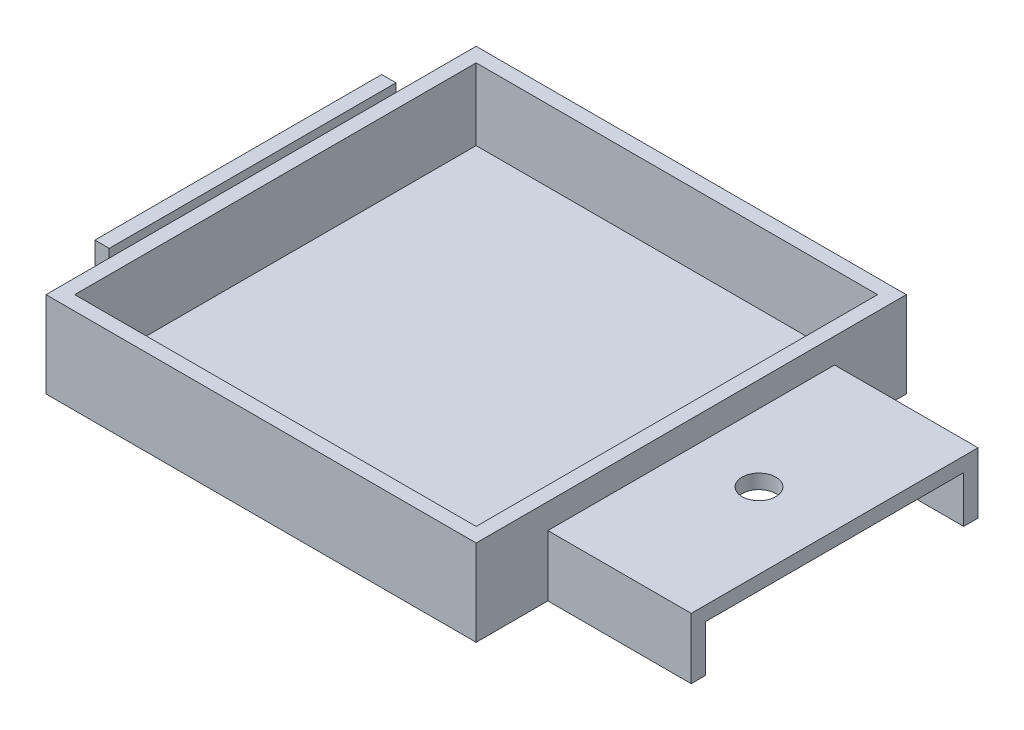
ISO-10303-21;
HEADER;
FILE_DESCRIPTION(('STEP AP214'),'2;1');
FILE_NAME('part.step','',(''),(''),'','','');
FILE_SCHEMA(('AUTOMOTIVE_DESIGN { 1 0 10303 214 1 1 1 1 }'));
ENDSEC;
DATA;
#1=APPLICATION_CONTEXT('core data for automotive mechanical design processes');
#2=APPLICATION_PROTOCOL_DEFINITION('international standard','automotive_design',2000,#1);
#3=PRODUCT_CONTEXT('',#1,'mechanical');
#4=PRODUCT('Part','Part','',(#3));
#5=PRODUCT_RELATED_PRODUCT_CATEGORY('part','',(#4));
#6=PRODUCT_DEFINITION_FORMATION('','',#4);
#7=PRODUCT_DEFINITION_CONTEXT('part definition',#1,'design');
#8=PRODUCT_DEFINITION('design','',#6,#7);
#9=PRODUCT_DEFINITION_SHAPE('','',#8);
#10=(LENGTH_UNIT() NAMED_UNIT(*) SI_UNIT(.MILLI.,.METRE.));
#11=(NAMED_UNIT(*) PLANE_ANGLE_UNIT() SI_UNIT($,.RADIAN.));
#12=(NAMED_UNIT(*) SI_UNIT($,.STERADIAN.) SOLID_ANGLE_UNIT());
#13=UNCERTAINTY_MEASURE_WITH_UNIT(LENGTH_MEASURE(1.E-05),#10,'distance_accuracy_value','');
#14=(GEOMETRIC_REPRESENTATION_CONTEXT(3) GLOBAL_UNCERTAINTY_ASSIGNED_CONTEXT((#13)) GLOBAL_UNIT_ASSIGNED_CONTEXT((#10,
#11,#12)) REPRESENTATION_CONTEXT('',''));
#15=CARTESIAN_POINT('',(0.,0.,0.));
#16=DIRECTION('',(0.,0.,1.));
#17=DIRECTION('',(1.,0.,0.));
#18=AXIS2_PLACEMENT_3D('',#15,#16,#17);
#19=CARTESIAN_POINT('',(0.,2.54,0.));
#20=DIRECTION('',(1.,0.,0.));
#21=DIRECTION('',(0.,0.,-1.));
#22=AXIS2_PLACEMENT_3D('',#19,#20,#21);
#23=PLANE('',#22);
#24=DIRECTION('',(0.,-1.,0.));
#25=VECTOR('',#24,1.);
#26=CARTESIAN_POINT('',(0.,2.54,-63.5));
#27=LINE('',#26,#25);
#28=CARTESIAN_POINT('',(0.,2.54,-63.5));
#29=VERTEX_POINT('',#28);
#30=CARTESIAN_POINT('',(0.,0.,-63.5));
#31=VERTEX_POINT('',#30);
#32=EDGE_CURVE('E58',#29,#31,#27,.T.);
#33=ORIENTED_EDGE('',*,*,#32,.F.);
#34=DIRECTION('',(0.,0.,-1.));
#35=VECTOR('',#34,1.);
#36=CARTESIAN_POINT('',(0.,2.54,-63.5));
#37=LINE('',#36,#35);
#38=CARTESIAN_POINT('',(0.,2.54,-12.7));
#39=VERTEX_POINT('',#38);
#40=EDGE_CURVE('E246',#39,#29,#37,.T.);
#41=ORIENTED_EDGE('',*,*,#40,.F.);
#42=DIRECTION('',(0.,1.,0.));
#43=VECTOR('',#42,1.);
#44=CARTESIAN_POINT('',(0.,2.54,-12.7));
#45=LINE('',#44,#43);
#46=CARTESIAN_POINT('',(0.,0.,-12.7));
#47=VERTEX_POINT('',#46);
#48=EDGE_CURVE('E64',#47,#39,#45,.T.);
#49=ORIENTED_EDGE('',*,*,#48,.F.);
#50=DIRECTION('',(0.,0.,1.));
#51=VECTOR('',#50,1.);
#52=CARTESIAN_POINT('',(0.,0.,0.));
#53=LINE('',#52,#51);
#54=CARTESIAN_POINT('',(0.,0.,0.));
#55=VERTEX_POINT('',#54);
#56=EDGE_CURVE('E406',#47,#55,#53,.T.);
#57=ORIENTED_EDGE('',*,*,#56,.T.);
#58=DIRECTION('',(0.,-1.,0.));
#59=VECTOR('',#58,1.);
#60=CARTESIAN_POINT('',(0.,2.54,0.));
#61=LINE('',#60,#59);
#62=CARTESIAN_POINT('',(0.,15.24,0.));
#63=VERTEX_POINT('',#62);
#64=EDGE_CURVE('E11',#63,#55,#61,.T.);
#65=ORIENTED_EDGE('',*,*,#64,.F.);
#66=DIRECTION('',(0.,0.,1.));
#67=VECTOR('',#66,1.);
#68=CARTESIAN_POINT('',(0.,15.24,-76.2));
#69=LINE('',#68,#67);
#70=CARTESIAN_POINT('',(0.,15.24,-76.2));
#71=VERTEX_POINT('',#70);
#72=EDGE_CURVE('E390',#71,#63,#69,.T.);
#73=ORIENTED_EDGE('',*,*,#72,.F.);
#74=DIRECTION('',(0.,-1.,0.));
#75=VECTOR('',#74,1.);
#76=CARTESIAN_POINT('',(0.,2.54,-76.2));
#77=LINE('',#76,#75);
#78=CARTESIAN_POINT('',(0.,0.,-76.2));
#79=VERTEX_POINT('',#78);
#80=EDGE_CURVE('E422',#71,#79,#77,.T.);
#81=ORIENTED_EDGE('',*,*,#80,.T.);
#82=EDGE_CURVE('E407',#79,#31,#53,.T.);
#83=ORIENTED_EDGE('',*,*,#82,.T.);
#84=EDGE_LOOP('',(#33,#41,#49,#57,#65,#73,#81,#83));
#85=FACE_BOUND('',#84,.T.);
#86=ADVANCED_FACE('F43',(#85),#23,.F.);
#87=CARTESIAN_POINT('',(76.2,2.54,0.));
#88=DIRECTION('',(-1.,0.,0.));
#89=DIRECTION('',(0.,0.,1.));
#90=AXIS2_PLACEMENT_3D('',#87,#88,#89);
#91=PLANE('',#90);
#92=DIRECTION('',(0.,1.,0.));
#93=VECTOR('',#92,1.);
#94=CARTESIAN_POINT('',(76.2,-25.5266840776471,-60.96));
#95=LINE('',#94,#93);
#96=CARTESIAN_POINT('',(76.2,0.,-60.96));
#97=VERTEX_POINT('',#96);
#98=CARTESIAN_POINT('',(76.2,8.255,-60.96));
#99=VERTEX_POINT('',#98);
#100=EDGE_CURVE('E261',#97,#99,#95,.T.);
#101=ORIENTED_EDGE('',*,*,#100,.T.);
#102=DIRECTION('',(0.,0.,-1.));
#103=VECTOR('',#102,1.);
#104=CARTESIAN_POINT('',(76.2,8.255,-12.7));
#105=LINE('',#104,#103);
#106=CARTESIAN_POINT('',(76.2,8.255,-15.24));
#107=VERTEX_POINT('',#106);
#108=EDGE_CURVE('E330',#107,#99,#105,.T.);
#109=ORIENTED_EDGE('',*,*,#108,.F.);
#110=DIRECTION('',(0.,1.,0.));
#111=VECTOR('',#110,1.);
#112=CARTESIAN_POINT('',(76.2,-25.5266840776471,-15.24));
#113=LINE('',#112,#111);
#114=CARTESIAN_POINT('',(76.2,0.,-15.24));
#115=VERTEX_POINT('',#114);
#116=EDGE_CURVE('E270',#115,#107,#113,.T.);
#117=ORIENTED_EDGE('',*,*,#116,.F.);
#118=DIRECTION('',(0.,0.,-1.));
#119=VECTOR('',#118,1.);
#120=CARTESIAN_POINT('',(76.2,0.,0.));
#121=LINE('',#120,#119);
#122=EDGE_CURVE('E419',#115,#97,#121,.T.);
#123=ORIENTED_EDGE('',*,*,#122,.T.);
#124=EDGE_LOOP('',(#101,#109,#117,#123));
#125=FACE_BOUND('',#124,.T.);
#126=ADVANCED_FACE('F468',(#125),#91,.F.);
#127=DIRECTION('',(0.,1.,0.));
#128=VECTOR('',#127,1.);
#129=CARTESIAN_POINT('',(76.2,10.795,-63.5));
#130=LINE('',#129,#128);
#131=CARTESIAN_POINT('',(76.2,0.,-63.5));
#132=VERTEX_POINT('',#131);
#133=CARTESIAN_POINT('',(76.2,10.795,-63.5));
#134=VERTEX_POINT('',#133);
#135=EDGE_CURVE('E334',#132,#134,#130,.T.);
#136=ORIENTED_EDGE('',*,*,#135,.F.);
#137=CARTESIAN_POINT('',(76.2,0.,-76.2));
#138=VERTEX_POINT('',#137);
#139=EDGE_CURVE('E413',#132,#138,#121,.T.);
#140=ORIENTED_EDGE('',*,*,#139,.T.);
#141=DIRECTION('',(0.,-1.,0.));
#142=VECTOR('',#141,1.);
#143=CARTESIAN_POINT('',(76.2,2.54,-76.2));
#144=LINE('',#143,#142);
#145=CARTESIAN_POINT('',(76.2,15.24,-76.2));
#146=VERTEX_POINT('',#145);
#147=EDGE_CURVE('E426',#146,#138,#144,.T.);
#148=ORIENTED_EDGE('',*,*,#147,.F.);
#149=DIRECTION('',(0.,0.,-1.));
#150=VECTOR('',#149,1.);
#151=CARTESIAN_POINT('',(76.2,15.24,-76.2));
#152=LINE('',#151,#150);
#153=CARTESIAN_POINT('',(76.2,15.24,0.));
#154=VERTEX_POINT('',#153);
#155=EDGE_CURVE('E398',#154,#146,#152,.T.);
#156=ORIENTED_EDGE('',*,*,#155,.F.);
#157=DIRECTION('',(0.,-1.,0.));
#158=VECTOR('',#157,1.);
#159=CARTESIAN_POINT('',(76.2,2.54,0.));
#160=LINE('',#159,#158);
#161=CARTESIAN_POINT('',(76.2,0.,0.));
#162=VERTEX_POINT('',#161);
#163=EDGE_CURVE('E51',#154,#162,#160,.T.);
#164=ORIENTED_EDGE('',*,*,#163,.T.);
#165=CARTESIAN_POINT('',(76.2,0.,-12.7));
#166=VERTEX_POINT('',#165);
#167=EDGE_CURVE('E414',#162,#166,#121,.T.);
#168=ORIENTED_EDGE('',*,*,#167,.T.);
#169=DIRECTION('',(0.,-1.,0.));
#170=VECTOR('',#169,1.);
#171=CARTESIAN_POINT('',(76.2,10.795,-12.7));
#172=LINE('',#171,#170);
#173=CARTESIAN_POINT('',(76.2,10.795,-12.7));
#174=VERTEX_POINT('',#173);
#175=EDGE_CURVE('E312',#174,#166,#172,.T.);
#176=ORIENTED_EDGE('',*,*,#175,.F.);
#177=DIRECTION('',(0.,0.,1.));
#178=VECTOR('',#177,1.);
#179=CARTESIAN_POINT('',(76.2,10.795,-12.7));
#180=LINE('',#179,#178);
#181=EDGE_CURVE('E317',#134,#174,#180,.T.);
#182=ORIENTED_EDGE('',*,*,#181,.F.);
#183=EDGE_LOOP('',(#136,#140,#148,#156,#164,#168,#176,#182));
#184=FACE_BOUND('',#183,.T.);
#185=ADVANCED_FACE('F434',(#184),#91,.F.);
#186=CARTESIAN_POINT('',(101.6,8.255,-12.7));
#187=DIRECTION('',(0.,1.,0.));
#188=DIRECTION('',(0.,0.,1.));
#189=AXIS2_PLACEMENT_3D('',#186,#187,#188);
#190=PLANE('',#189);
#191=CARTESIAN_POINT('',(88.2,8.255,-38.1));
#192=DIRECTION('',(0.,1.,0.));
#193=DIRECTION('',(0.,0.,1.));
#194=AXIS2_PLACEMENT_3D('',#191,#192,#193);
#195=CIRCLE('',#194,3.00000000000001);
#196=CARTESIAN_POINT('',(88.2,8.255,-35.1));
#197=VERTEX_POINT('',#196);
#198=EDGE_CURVE('E308',#197,#197,#195,.T.);
#199=ORIENTED_EDGE('',*,*,#198,.T.);
#200=EDGE_LOOP('',(#199));
#201=FACE_BOUND('',#200,.T.);
#202=DIRECTION('',(-1.,0.,0.));
#203=VECTOR('',#202,1.);
#204=CARTESIAN_POINT('',(76.2,8.255,-60.96));
#205=LINE('',#204,#203);
#206=CARTESIAN_POINT('',(101.6,8.255,-60.96));
#207=VERTEX_POINT('',#206);
#208=EDGE_CURVE('E265',#207,#99,#205,.T.);
#209=ORIENTED_EDGE('',*,*,#208,.F.);
#210=DIRECTION('',(0.,0.,-1.));
#211=VECTOR('',#210,1.);
#212=CARTESIAN_POINT('',(101.6,8.255,-12.7));
#213=LINE('',#212,#211);
#214=CARTESIAN_POINT('',(101.6,8.255,-15.24));
#215=VERTEX_POINT('',#214);
#216=EDGE_CURVE('E316',#215,#207,#213,.T.);
#217=ORIENTED_EDGE('',*,*,#216,.F.);
#218=DIRECTION('',(1.,0.,0.));
#219=VECTOR('',#218,1.);
#220=CARTESIAN_POINT('',(101.6,8.255,-15.24));
#221=LINE('',#220,#219);
#222=EDGE_CURVE('E283',#107,#215,#221,.T.);
#223=ORIENTED_EDGE('',*,*,#222,.F.);
#224=ORIENTED_EDGE('',*,*,#108,.T.);
#225=EDGE_LOOP('',(#209,#217,#223,#224));
#226=FACE_BOUND('',#225,.T.);
#227=ADVANCED_FACE('F480',(#201,#226),#190,.F.);
#228=CARTESIAN_POINT('',(0.,2.54,0.));
#229=DIRECTION('',(0.,0.,-1.));
#230=DIRECTION('',(-1.,0.,0.));
#231=AXIS2_PLACEMENT_3D('',#228,#229,#230);
#232=PLANE('',#231);
#233=DIRECTION('',(1.,0.,0.));
#234=VECTOR('',#233,1.);
#235=CARTESIAN_POINT('',(0.,0.,0.));
#236=LINE('',#235,#234);
#237=EDGE_CURVE('E410',#55,#162,#236,.T.);
#238=ORIENTED_EDGE('',*,*,#237,.T.);
#239=ORIENTED_EDGE('',*,*,#163,.F.);
#240=DIRECTION('',(1.,0.,0.));
#241=VECTOR('',#240,1.);
#242=CARTESIAN_POINT('',(0.,15.24,0.));
#243=LINE('',#242,#241);
#244=EDGE_CURVE('E394',#63,#154,#243,.T.);
#245=ORIENTED_EDGE('',*,*,#244,.F.);
#246=ORIENTED_EDGE('',*,*,#64,.T.);
#247=EDGE_LOOP('',(#238,#239,#245,#246));
#248=FACE_BOUND('',#247,.T.);
#249=ADVANCED_FACE('F461',(#248),#232,.F.);
#250=CARTESIAN_POINT('',(0.,2.54,-76.2));
#251=DIRECTION('',(0.,0.,1.));
#252=DIRECTION('',(1.,0.,0.));
#253=AXIS2_PLACEMENT_3D('',#250,#251,#252);
#254=PLANE('',#253);
#255=DIRECTION('',(-1.,0.,0.));
#256=VECTOR('',#255,1.);
#257=CARTESIAN_POINT('',(0.,0.,-76.2));
#258=LINE('',#257,#256);
#259=EDGE_CURVE('E418',#138,#79,#258,.T.);
#260=ORIENTED_EDGE('',*,*,#259,.T.);
#261=ORIENTED_EDGE('',*,*,#80,.F.);
#262=DIRECTION('',(-1.,0.,0.));
#263=VECTOR('',#262,1.);
#264=CARTESIAN_POINT('',(0.,15.24,-76.2));
#265=LINE('',#264,#263);
#266=EDGE_CURVE('E402',#146,#71,#265,.T.);
#267=ORIENTED_EDGE('',*,*,#266,.F.);
#268=ORIENTED_EDGE('',*,*,#147,.T.);
#269=EDGE_LOOP('',(#260,#261,#267,#268));
#270=FACE_BOUND('',#269,.T.);
#271=ADVANCED_FACE('F456',(#270),#254,.F.);
#272=CARTESIAN_POINT('',(0.,0.,0.));
#273=DIRECTION('',(0.,-1.,0.));
#274=DIRECTION('',(0.,0.,-1.));
#275=AXIS2_PLACEMENT_3D('',#272,#273,#274);
#276=PLANE('',#275);
#277=ORIENTED_EDGE('',*,*,#82,.F.);
#278=ORIENTED_EDGE('',*,*,#259,.F.);
#279=ORIENTED_EDGE('',*,*,#139,.F.);
#280=DIRECTION('',(1.,0.,0.));
#281=VECTOR('',#280,1.);
#282=CARTESIAN_POINT('',(101.6,0.,-63.5));
#283=LINE('',#282,#281);
#284=CARTESIAN_POINT('',(101.6,0.,-63.5));
#285=VERTEX_POINT('',#284);
#286=EDGE_CURVE('E266',#132,#285,#283,.T.);
#287=ORIENTED_EDGE('',*,*,#286,.T.);
#288=DIRECTION('',(0.,0.,1.));
#289=VECTOR('',#288,1.);
#290=CARTESIAN_POINT('',(101.6,0.,-60.96));
#291=LINE('',#290,#289);
#292=CARTESIAN_POINT('',(101.6,0.,-60.96));
#293=VERTEX_POINT('',#292);
#294=EDGE_CURVE('E274',#285,#293,#291,.T.);
#295=ORIENTED_EDGE('',*,*,#294,.T.);
#296=DIRECTION('',(-1.,0.,0.));
#297=VECTOR('',#296,1.);
#298=CARTESIAN_POINT('',(76.2,0.,-60.96));
#299=LINE('',#298,#297);
#300=EDGE_CURVE('E201',#293,#97,#299,.T.);
#301=ORIENTED_EDGE('',*,*,#300,.T.);
#302=ORIENTED_EDGE('',*,*,#122,.F.);
#303=DIRECTION('',(1.,0.,0.));
#304=VECTOR('',#303,1.);
#305=CARTESIAN_POINT('',(101.6,0.,-15.24));
#306=LINE('',#305,#304);
#307=CARTESIAN_POINT('',(101.6,0.,-15.24));
#308=VERTEX_POINT('',#307);
#309=EDGE_CURVE('E292',#115,#308,#306,.T.);
#310=ORIENTED_EDGE('',*,*,#309,.T.);
#311=DIRECTION('',(0.,0.,1.));
#312=VECTOR('',#311,1.);
#313=CARTESIAN_POINT('',(101.6,0.,-12.7));
#314=LINE('',#313,#312);
#315=CARTESIAN_POINT('',(101.6,0.,-12.7));
#316=VERTEX_POINT('',#315);
#317=EDGE_CURVE('E287',#308,#316,#314,.T.);
#318=ORIENTED_EDGE('',*,*,#317,.T.);
#319=DIRECTION('',(-1.,0.,0.));
#320=VECTOR('',#319,1.);
#321=CARTESIAN_POINT('',(76.2,0.,-12.7));
#322=LINE('',#321,#320);
#323=EDGE_CURVE('E296',#316,#166,#322,.T.);
#324=ORIENTED_EDGE('',*,*,#323,.T.);
#325=ORIENTED_EDGE('',*,*,#167,.F.);
#326=ORIENTED_EDGE('',*,*,#237,.F.);
#327=ORIENTED_EDGE('',*,*,#56,.F.);
#328=DIRECTION('',(1.,0.,0.));
#329=VECTOR('',#328,1.);
#330=CARTESIAN_POINT('',(-1.5,0.,-12.7));
#331=LINE('',#330,#329);
#332=CARTESIAN_POINT('',(-4.04,0.,-12.7));
#333=VERTEX_POINT('',#332);
#334=EDGE_CURVE('E202',#333,#47,#331,.T.);
#335=ORIENTED_EDGE('',*,*,#334,.F.);
#336=DIRECTION('',(0.,0.,1.));
#337=VECTOR('',#336,1.);
#338=CARTESIAN_POINT('',(-4.04000000000002,0.,-63.5));
#339=LINE('',#338,#337);
#340=CARTESIAN_POINT('',(-4.04000000000002,0.,-63.5));
#341=VERTEX_POINT('',#340);
#342=EDGE_CURVE('E205',#341,#333,#339,.T.);
#343=ORIENTED_EDGE('',*,*,#342,.F.);
#344=DIRECTION('',(1.,0.,0.));
#345=VECTOR('',#344,1.);
#346=CARTESIAN_POINT('',(-1.50000000000002,0.,-63.5));
#347=LINE('',#346,#345);
#348=EDGE_CURVE('E191',#341,#31,#347,.T.);
#349=ORIENTED_EDGE('',*,*,#348,.T.);
#350=EDGE_LOOP('',(#277,#278,#279,#287,#295,#301,#302,#310,#318,#324,#325,#326,#327,#335,#343,#349));
#351=FACE_BOUND('',#350,.T.);
#352=ADVANCED_FACE('F206',(#351),#276,.T.);
#353=CARTESIAN_POINT('',(0.,15.24,0.));
#354=DIRECTION('',(0.,1.,0.));
#355=DIRECTION('',(0.,0.,1.));
#356=AXIS2_PLACEMENT_3D('',#353,#354,#355);
#357=PLANE('',#356);
#358=ORIENTED_EDGE('',*,*,#72,.T.);
#359=ORIENTED_EDGE('',*,*,#244,.T.);
#360=ORIENTED_EDGE('',*,*,#155,.T.);
#361=ORIENTED_EDGE('',*,*,#266,.T.);
#362=EDGE_LOOP('',(#358,#359,#360,#361));
#363=FACE_BOUND('',#362,.T.);
#364=DIRECTION('',(1.,0.,0.));
#365=VECTOR('',#364,1.);
#366=CARTESIAN_POINT('',(2.54000000000001,15.24,-2.54));
#367=LINE('',#366,#365);
#368=CARTESIAN_POINT('',(2.54000000000001,15.24,-2.54));
#369=VERTEX_POINT('',#368);
#370=CARTESIAN_POINT('',(73.66,15.24,-2.54000000000003));
#371=VERTEX_POINT('',#370);
#372=EDGE_CURVE('E352',#369,#371,#367,.T.);
#373=ORIENTED_EDGE('',*,*,#372,.F.);
#374=DIRECTION('',(0.,0.,1.));
#375=VECTOR('',#374,1.);
#376=CARTESIAN_POINT('',(2.54000000000001,15.24,-73.66));
#377=LINE('',#376,#375);
#378=CARTESIAN_POINT('',(2.54000000000001,15.24,-73.66));
#379=VERTEX_POINT('',#378);
#380=EDGE_CURVE('E349',#379,#369,#377,.T.);
#381=ORIENTED_EDGE('',*,*,#380,.F.);
#382=DIRECTION('',(-1.,0.,0.));
#383=VECTOR('',#382,1.);
#384=CARTESIAN_POINT('',(2.54000000000001,15.24,-73.66));
#385=LINE('',#384,#383);
#386=CARTESIAN_POINT('',(73.66,15.24,-73.66));
#387=VERTEX_POINT('',#386);
#388=EDGE_CURVE('E360',#387,#379,#385,.T.);
#389=ORIENTED_EDGE('',*,*,#388,.F.);
#390=DIRECTION('',(0.,0.,-1.));
#391=VECTOR('',#390,1.);
#392=CARTESIAN_POINT('',(73.66,15.24,-73.66));
#393=LINE('',#392,#391);
#394=EDGE_CURVE('E356',#371,#387,#393,.T.);
#395=ORIENTED_EDGE('',*,*,#394,.F.);
#396=EDGE_LOOP('',(#373,#381,#389,#395));
#397=FACE_BOUND('',#396,.T.);
#398=ADVANCED_FACE('F459',(#363,#397),#357,.T.);
#399=CARTESIAN_POINT('',(2.54000000000001,15.24,-73.66));
#400=DIRECTION('',(1.,0.,0.));
#401=DIRECTION('',(0.,0.,-1.));
#402=AXIS2_PLACEMENT_3D('',#399,#400,#401);
#403=PLANE('',#402);
#404=DIRECTION('',(0.,0.,1.));
#405=VECTOR('',#404,1.);
#406=CARTESIAN_POINT('',(2.54000000000001,2.54,-73.66));
#407=LINE('',#406,#405);
#408=CARTESIAN_POINT('',(2.54000000000001,2.54,-73.66));
#409=VERTEX_POINT('',#408);
#410=CARTESIAN_POINT('',(2.54000000000001,2.54,-2.54));
#411=VERTEX_POINT('',#410);
#412=EDGE_CURVE('E348',#409,#411,#407,.T.);
#413=ORIENTED_EDGE('',*,*,#412,.F.);
#414=DIRECTION('',(0.,-1.,0.));
#415=VECTOR('',#414,1.);
#416=CARTESIAN_POINT('',(2.54000000000001,15.24,-73.66));
#417=LINE('',#416,#415);
#418=EDGE_CURVE('E363',#379,#409,#417,.T.);
#419=ORIENTED_EDGE('',*,*,#418,.F.);
#420=ORIENTED_EDGE('',*,*,#380,.T.);
#421=DIRECTION('',(0.,-1.,0.));
#422=VECTOR('',#421,1.);
#423=CARTESIAN_POINT('',(2.54000000000001,15.24,-2.54));
#424=LINE('',#423,#422);
#425=EDGE_CURVE('E386',#369,#411,#424,.T.);
#426=ORIENTED_EDGE('',*,*,#425,.T.);
#427=EDGE_LOOP('',(#413,#419,#420,#426));
#428=FACE_BOUND('',#427,.T.);
#429=ADVANCED_FACE('F529',(#428),#403,.T.);
#430=CARTESIAN_POINT('',(2.54000000000001,15.24,-2.54));
#431=DIRECTION('',(0.,0.,-1.));
#432=DIRECTION('',(-1.,0.,0.));
#433=AXIS2_PLACEMENT_3D('',#430,#431,#432);
#434=PLANE('',#433);
#435=DIRECTION('',(1.,0.,0.));
#436=VECTOR('',#435,1.);
#437=CARTESIAN_POINT('',(2.54000000000001,2.54,-2.54));
#438=LINE('',#437,#436);
#439=CARTESIAN_POINT('',(73.66,2.54,-2.54000000000003));
#440=VERTEX_POINT('',#439);
#441=EDGE_CURVE('E367',#411,#440,#438,.T.);
#442=ORIENTED_EDGE('',*,*,#441,.F.);
#443=ORIENTED_EDGE('',*,*,#425,.F.);
#444=ORIENTED_EDGE('',*,*,#372,.T.);
#445=DIRECTION('',(0.,-1.,0.));
#446=VECTOR('',#445,1.);
#447=CARTESIAN_POINT('',(73.66,15.24,-2.54000000000003));
#448=LINE('',#447,#446);
#449=EDGE_CURVE('E383',#371,#440,#448,.T.);
#450=ORIENTED_EDGE('',*,*,#449,.T.);
#451=EDGE_LOOP('',(#442,#443,#444,#450));
#452=FACE_BOUND('',#451,.T.);
#453=ADVANCED_FACE('F525',(#452),#434,.T.);
#454=CARTESIAN_POINT('',(73.66,15.24,-73.66));
#455=DIRECTION('',(-1.,0.,0.));
#456=DIRECTION('',(0.,0.,1.));
#457=AXIS2_PLACEMENT_3D('',#454,#455,#456);
#458=PLANE('',#457);
#459=DIRECTION('',(0.,0.,-1.));
#460=VECTOR('',#459,1.);
#461=CARTESIAN_POINT('',(73.66,2.54,-73.66));
#462=LINE('',#461,#460);
#463=CARTESIAN_POINT('',(73.66,2.54,-73.66));
#464=VERTEX_POINT('',#463);
#465=EDGE_CURVE('E371',#440,#464,#462,.T.);
#466=ORIENTED_EDGE('',*,*,#465,.F.);
#467=ORIENTED_EDGE('',*,*,#449,.F.);
#468=ORIENTED_EDGE('',*,*,#394,.T.);
#469=DIRECTION('',(0.,-1.,0.));
#470=VECTOR('',#469,1.);
#471=CARTESIAN_POINT('',(73.66,15.24,-73.66));
#472=LINE('',#471,#470);
#473=EDGE_CURVE('E380',#387,#464,#472,.T.);
#474=ORIENTED_EDGE('',*,*,#473,.T.);
#475=EDGE_LOOP('',(#466,#467,#468,#474));
#476=FACE_BOUND('',#475,.T.);
#477=ADVANCED_FACE('F521',(#476),#458,.T.);
#478=CARTESIAN_POINT('',(2.54000000000001,15.24,-73.66));
#479=DIRECTION('',(0.,0.,1.));
#480=DIRECTION('',(1.,0.,0.));
#481=AXIS2_PLACEMENT_3D('',#478,#479,#480);
#482=PLANE('',#481);
#483=DIRECTION('',(-1.,0.,0.));
#484=VECTOR('',#483,1.);
#485=CARTESIAN_POINT('',(2.54000000000001,2.54,-73.66));
#486=LINE('',#485,#484);
#487=EDGE_CURVE('E353',#464,#409,#486,.T.);
#488=ORIENTED_EDGE('',*,*,#487,.F.);
#489=ORIENTED_EDGE('',*,*,#473,.F.);
#490=ORIENTED_EDGE('',*,*,#388,.T.);
#491=ORIENTED_EDGE('',*,*,#418,.T.);
#492=EDGE_LOOP('',(#488,#489,#490,#491));
#493=FACE_BOUND('',#492,.T.);
#494=ADVANCED_FACE('F518',(#493),#482,.T.);
#495=CARTESIAN_POINT('',(0.,2.54,0.));
#496=DIRECTION('',(0.,-1.,0.));
#497=DIRECTION('',(0.,0.,-1.));
#498=AXIS2_PLACEMENT_3D('',#495,#496,#497);
#499=PLANE('',#498);
#500=ORIENTED_EDGE('',*,*,#487,.T.);
#501=ORIENTED_EDGE('',*,*,#412,.T.);
#502=ORIENTED_EDGE('',*,*,#441,.T.);
#503=ORIENTED_EDGE('',*,*,#465,.T.);
#504=EDGE_LOOP('',(#500,#501,#502,#503));
#505=FACE_BOUND('',#504,.T.);
#506=ADVANCED_FACE('F517',(#505),#499,.F.);
#507=CARTESIAN_POINT('',(101.6,10.795,-12.7));
#508=DIRECTION('',(0.,0.,-1.));
#509=DIRECTION('',(-1.,0.,0.));
#510=AXIS2_PLACEMENT_3D('',#507,#508,#509);
#511=PLANE('',#510);
#512=ORIENTED_EDGE('',*,*,#175,.T.);
#513=ORIENTED_EDGE('',*,*,#323,.F.);
#514=DIRECTION('',(0.,-1.,0.));
#515=VECTOR('',#514,1.);
#516=CARTESIAN_POINT('',(101.6,10.795,-12.7));
#517=LINE('',#516,#515);
#518=CARTESIAN_POINT('',(101.6,10.795,-12.7));
#519=VERTEX_POINT('',#518);
#520=EDGE_CURVE('E313',#519,#316,#517,.T.);
#521=ORIENTED_EDGE('',*,*,#520,.F.);
#522=DIRECTION('',(-1.,0.,0.));
#523=VECTOR('',#522,1.);
#524=CARTESIAN_POINT('',(101.6,10.795,-12.7));
#525=LINE('',#524,#523);
#526=EDGE_CURVE('E327',#519,#174,#525,.T.);
#527=ORIENTED_EDGE('',*,*,#526,.T.);
#528=EDGE_LOOP('',(#512,#513,#521,#527));
#529=FACE_BOUND('',#528,.T.);
#530=ADVANCED_FACE('F441',(#529),#511,.F.);
#531=CARTESIAN_POINT('',(101.6,10.795,-63.5));
#532=DIRECTION('',(0.,0.,1.));
#533=DIRECTION('',(1.,0.,0.));
#534=AXIS2_PLACEMENT_3D('',#531,#532,#533);
#535=PLANE('',#534);
#536=ORIENTED_EDGE('',*,*,#135,.T.);
#537=DIRECTION('',(-1.,0.,0.));
#538=VECTOR('',#537,1.);
#539=CARTESIAN_POINT('',(101.6,10.795,-63.5));
#540=LINE('',#539,#538);
#541=CARTESIAN_POINT('',(101.6,10.795,-63.5));
#542=VERTEX_POINT('',#541);
#543=EDGE_CURVE('E344',#542,#134,#540,.T.);
#544=ORIENTED_EDGE('',*,*,#543,.F.);
#545=DIRECTION('',(0.,1.,0.));
#546=VECTOR('',#545,1.);
#547=CARTESIAN_POINT('',(101.6,10.795,-63.5));
#548=LINE('',#547,#546);
#549=EDGE_CURVE('E321',#285,#542,#548,.T.);
#550=ORIENTED_EDGE('',*,*,#549,.F.);
#551=ORIENTED_EDGE('',*,*,#286,.F.);
#552=EDGE_LOOP('',(#536,#544,#550,#551));
#553=FACE_BOUND('',#552,.T.);
#554=ADVANCED_FACE('F448',(#553),#535,.F.);
#555=CARTESIAN_POINT('',(101.6,10.795,-12.7));
#556=DIRECTION('',(0.,-1.,0.));
#557=DIRECTION('',(0.,0.,-1.));
#558=AXIS2_PLACEMENT_3D('',#555,#556,#557);
#559=PLANE('',#558);
#560=CARTESIAN_POINT('',(88.2,10.795,-38.1));
#561=DIRECTION('',(0.,1.,0.));
#562=DIRECTION('',(0.,0.,1.));
#563=AXIS2_PLACEMENT_3D('',#560,#561,#562);
#564=CIRCLE('',#563,3.00000000000001);
#565=CARTESIAN_POINT('',(88.2,10.795,-35.1));
#566=VERTEX_POINT('',#565);
#567=EDGE_CURVE('E291',#566,#566,#564,.T.);
#568=ORIENTED_EDGE('',*,*,#567,.F.);
#569=EDGE_LOOP('',(#568));
#570=FACE_BOUND('',#569,.T.);
#571=ORIENTED_EDGE('',*,*,#181,.T.);
#572=ORIENTED_EDGE('',*,*,#526,.F.);
#573=DIRECTION('',(0.,0.,1.));
#574=VECTOR('',#573,1.);
#575=CARTESIAN_POINT('',(101.6,10.795,-12.7));
#576=LINE('',#575,#574);
#577=EDGE_CURVE('E324',#542,#519,#576,.T.);
#578=ORIENTED_EDGE('',*,*,#577,.F.);
#579=ORIENTED_EDGE('',*,*,#543,.T.);
#580=EDGE_LOOP('',(#571,#572,#578,#579));
#581=FACE_BOUND('',#580,.T.);
#582=ADVANCED_FACE('F444',(#570,#581),#559,.F.);
#583=CARTESIAN_POINT('',(101.6,0.,0.));
#584=DIRECTION('',(1.,0.,0.));
#585=DIRECTION('',(0.,0.,-1.));
#586=AXIS2_PLACEMENT_3D('',#583,#584,#585);
#587=PLANE('',#586);
#588=ORIENTED_EDGE('',*,*,#520,.T.);
#589=ORIENTED_EDGE('',*,*,#317,.F.);
#590=DIRECTION('',(0.,1.,0.));
#591=VECTOR('',#590,1.);
#592=CARTESIAN_POINT('',(101.6,-25.5266840776471,-15.24));
#593=LINE('',#592,#591);
#594=EDGE_CURVE('E286',#308,#215,#593,.T.);
#595=ORIENTED_EDGE('',*,*,#594,.T.);
#596=ORIENTED_EDGE('',*,*,#216,.T.);
#597=DIRECTION('',(0.,1.,0.));
#598=VECTOR('',#597,1.);
#599=CARTESIAN_POINT('',(101.6,-25.5266840776471,-60.96));
#600=LINE('',#599,#598);
#601=EDGE_CURVE('E267',#293,#207,#600,.T.);
#602=ORIENTED_EDGE('',*,*,#601,.F.);
#603=ORIENTED_EDGE('',*,*,#294,.F.);
#604=ORIENTED_EDGE('',*,*,#549,.T.);
#605=ORIENTED_EDGE('',*,*,#577,.T.);
#606=EDGE_LOOP('',(#588,#589,#595,#596,#602,#603,#604,#605));
#607=FACE_BOUND('',#606,.T.);
#608=ADVANCED_FACE('F475',(#607),#587,.T.);
#609=CARTESIAN_POINT('',(88.2,0.,-38.1));
#610=DIRECTION('',(0.,1.,0.));
#611=DIRECTION('',(0.,0.,1.));
#612=AXIS2_PLACEMENT_3D('',#609,#610,#611);
#613=CYLINDRICAL_SURFACE('',#612,3.00000000000001);
#614=ORIENTED_EDGE('',*,*,#567,.T.);
#615=EDGE_LOOP('',(#614));
#616=FACE_BOUND('',#615,.T.);
#617=ORIENTED_EDGE('',*,*,#198,.F.);
#618=EDGE_LOOP('',(#617));
#619=FACE_BOUND('',#618,.T.);
#620=ADVANCED_FACE('F484',(#616,#619),#613,.F.);
#621=CARTESIAN_POINT('',(101.6,-25.5266840776471,-15.24));
#622=DIRECTION('',(0.,0.,1.));
#623=DIRECTION('',(1.,0.,0.));
#624=AXIS2_PLACEMENT_3D('',#621,#622,#623);
#625=PLANE('',#624);
#626=ORIENTED_EDGE('',*,*,#309,.F.);
#627=ORIENTED_EDGE('',*,*,#116,.T.);
#628=ORIENTED_EDGE('',*,*,#222,.T.);
#629=ORIENTED_EDGE('',*,*,#594,.F.);
#630=EDGE_LOOP('',(#626,#627,#628,#629));
#631=FACE_BOUND('',#630,.T.);
#632=ADVANCED_FACE('F482',(#631),#625,.F.);
#633=CARTESIAN_POINT('',(76.2,-25.5266840776471,-60.96));
#634=DIRECTION('',(0.,0.,-1.));
#635=DIRECTION('',(-1.,0.,0.));
#636=AXIS2_PLACEMENT_3D('',#633,#634,#635);
#637=PLANE('',#636);
#638=ORIENTED_EDGE('',*,*,#300,.F.);
#639=ORIENTED_EDGE('',*,*,#601,.T.);
#640=ORIENTED_EDGE('',*,*,#208,.T.);
#641=ORIENTED_EDGE('',*,*,#100,.F.);
#642=EDGE_LOOP('',(#638,#639,#640,#641));
#643=FACE_BOUND('',#642,.T.);
#644=ADVANCED_FACE('F472',(#643),#637,.F.);
#645=CARTESIAN_POINT('',(-1.50000000000002,2.54,-63.5));
#646=DIRECTION('',(0.,0.,1.));
#647=DIRECTION('',(1.,0.,0.));
#648=AXIS2_PLACEMENT_3D('',#645,#646,#647);
#649=PLANE('',#648);
#650=ORIENTED_EDGE('',*,*,#32,.T.);
#651=ORIENTED_EDGE('',*,*,#348,.F.);
#652=DIRECTION('',(0.,-1.,0.));
#653=VECTOR('',#652,1.);
#654=CARTESIAN_POINT('',(-4.04000000000002,0.,-63.5));
#655=LINE('',#654,#653);
#656=CARTESIAN_POINT('',(-4.04000000000002,15.24,-63.5));
#657=VERTEX_POINT('',#656);
#658=EDGE_CURVE('E196',#657,#341,#655,.T.);
#659=ORIENTED_EDGE('',*,*,#658,.F.);
#660=DIRECTION('',(1.,0.,0.));
#661=VECTOR('',#660,1.);
#662=CARTESIAN_POINT('',(-4.04000000000002,15.24,-63.5));
#663=LINE('',#662,#661);
#664=CARTESIAN_POINT('',(-1.50000000000002,15.24,-63.5));
#665=VERTEX_POINT('',#664);
#666=EDGE_CURVE('E228',#657,#665,#663,.T.);
#667=ORIENTED_EDGE('',*,*,#666,.T.);
#668=DIRECTION('',(0.,-1.,0.));
#669=VECTOR('',#668,1.);
#670=CARTESIAN_POINT('',(-1.50000000000002,0.,-63.5));
#671=LINE('',#670,#669);
#672=CARTESIAN_POINT('',(-1.50000000000002,2.54,-63.5));
#673=VERTEX_POINT('',#672);
#674=EDGE_CURVE('E229',#665,#673,#671,.T.);
#675=ORIENTED_EDGE('',*,*,#674,.T.);
#676=DIRECTION('',(1.,0.,0.));
#677=VECTOR('',#676,1.);
#678=CARTESIAN_POINT('',(-1.50000000000002,2.54,-63.5));
#679=LINE('',#678,#677);
#680=EDGE_CURVE('E245',#673,#29,#679,.T.);
#681=ORIENTED_EDGE('',*,*,#680,.T.);
#682=EDGE_LOOP('',(#650,#651,#659,#667,#675,#681));
#683=FACE_BOUND('',#682,.T.);
#684=ADVANCED_FACE('F193',(#683),#649,.F.);
#685=CARTESIAN_POINT('',(-1.5,2.54,-12.7));
#686=DIRECTION('',(0.,0.,-1.));
#687=DIRECTION('',(-1.,0.,0.));
#688=AXIS2_PLACEMENT_3D('',#685,#686,#687);
#689=PLANE('',#688);
#690=ORIENTED_EDGE('',*,*,#48,.T.);
#691=DIRECTION('',(1.,0.,0.));
#692=VECTOR('',#691,1.);
#693=CARTESIAN_POINT('',(-1.5,2.54,-12.7));
#694=LINE('',#693,#692);
#695=CARTESIAN_POINT('',(-1.5,2.54,-12.7));
#696=VERTEX_POINT('',#695);
#697=EDGE_CURVE('E255',#696,#39,#694,.T.);
#698=ORIENTED_EDGE('',*,*,#697,.F.);
#699=DIRECTION('',(0.,1.,0.));
#700=VECTOR('',#699,1.);
#701=CARTESIAN_POINT('',(-1.5,0.,-12.7));
#702=LINE('',#701,#700);
#703=CARTESIAN_POINT('',(-1.5,15.24,-12.7));
#704=VERTEX_POINT('',#703);
#705=EDGE_CURVE('E221',#696,#704,#702,.T.);
#706=ORIENTED_EDGE('',*,*,#705,.T.);
#707=DIRECTION('',(1.,0.,0.));
#708=VECTOR('',#707,1.);
#709=CARTESIAN_POINT('',(-4.04,15.24,-12.7));
#710=LINE('',#709,#708);
#711=CARTESIAN_POINT('',(-4.04,15.24,-12.7));
#712=VERTEX_POINT('',#711);
#713=EDGE_CURVE('E237',#712,#704,#710,.T.);
#714=ORIENTED_EDGE('',*,*,#713,.F.);
#715=DIRECTION('',(0.,1.,0.));
#716=VECTOR('',#715,1.);
#717=CARTESIAN_POINT('',(-4.04,0.,-12.7));
#718=LINE('',#717,#716);
#719=EDGE_CURVE('E211',#333,#712,#718,.T.);
#720=ORIENTED_EDGE('',*,*,#719,.F.);
#721=ORIENTED_EDGE('',*,*,#334,.T.);
#722=EDGE_LOOP('',(#690,#698,#706,#714,#720,#721));
#723=FACE_BOUND('',#722,.T.);
#724=ADVANCED_FACE('F686',(#723),#689,.F.);
#725=CARTESIAN_POINT('',(-1.50000000000002,2.54,-63.5));
#726=DIRECTION('',(0.,-1.,0.));
#727=DIRECTION('',(0.,0.,-1.));
#728=AXIS2_PLACEMENT_3D('',#725,#726,#727);
#729=PLANE('',#728);
#730=ORIENTED_EDGE('',*,*,#40,.T.);
#731=ORIENTED_EDGE('',*,*,#680,.F.);
#732=DIRECTION('',(0.,0.,-1.));
#733=VECTOR('',#732,1.);
#734=CARTESIAN_POINT('',(-1.50000000000002,2.54,-63.5));
#735=LINE('',#734,#733);
#736=EDGE_CURVE('E241',#696,#673,#735,.T.);
#737=ORIENTED_EDGE('',*,*,#736,.F.);
#738=ORIENTED_EDGE('',*,*,#697,.T.);
#739=EDGE_LOOP('',(#730,#731,#737,#738));
#740=FACE_BOUND('',#739,.T.);
#741=ADVANCED_FACE('F695',(#740),#729,.F.);
#742=CARTESIAN_POINT('',(-4.04000000000002,15.24,-63.5));
#743=DIRECTION('',(0.,-1.,0.));
#744=DIRECTION('',(0.,0.,-1.));
#745=AXIS2_PLACEMENT_3D('',#742,#743,#744);
#746=PLANE('',#745);
#747=DIRECTION('',(0.,0.,-1.));
#748=VECTOR('',#747,1.);
#749=CARTESIAN_POINT('',(-1.50000000000002,15.24,-63.5));
#750=LINE('',#749,#748);
#751=EDGE_CURVE('E218',#704,#665,#750,.T.);
#752=ORIENTED_EDGE('',*,*,#751,.T.);
#753=ORIENTED_EDGE('',*,*,#666,.F.);
#754=DIRECTION('',(0.,0.,-1.));
#755=VECTOR('',#754,1.);
#756=CARTESIAN_POINT('',(-4.04000000000002,15.24,-63.5));
#757=LINE('',#756,#755);
#758=EDGE_CURVE('E215',#712,#657,#757,.T.);
#759=ORIENTED_EDGE('',*,*,#758,.F.);
#760=ORIENTED_EDGE('',*,*,#713,.T.);
#761=EDGE_LOOP('',(#752,#753,#759,#760));
#762=FACE_BOUND('',#761,.T.);
#763=ADVANCED_FACE('F705',(#762),#746,.F.);
#764=CARTESIAN_POINT('',(-4.04,0.,0.));
#765=DIRECTION('',(1.,0.,0.));
#766=DIRECTION('',(0.,0.,-1.));
#767=AXIS2_PLACEMENT_3D('',#764,#765,#766);
#768=PLANE('',#767);
#769=ORIENTED_EDGE('',*,*,#658,.T.);
#770=ORIENTED_EDGE('',*,*,#342,.T.);
#771=ORIENTED_EDGE('',*,*,#719,.T.);
#772=ORIENTED_EDGE('',*,*,#758,.T.);
#773=EDGE_LOOP('',(#769,#770,#771,#772));
#774=FACE_BOUND('',#773,.T.);
#775=ADVANCED_FACE('F213',(#774),#768,.F.);
#776=CARTESIAN_POINT('',(-1.5,0.,0.));
#777=DIRECTION('',(1.,0.,0.));
#778=DIRECTION('',(0.,0.,-1.));
#779=AXIS2_PLACEMENT_3D('',#776,#777,#778);
#780=PLANE('',#779);
#781=ORIENTED_EDGE('',*,*,#705,.F.);
#782=ORIENTED_EDGE('',*,*,#736,.T.);
#783=ORIENTED_EDGE('',*,*,#674,.F.);
#784=ORIENTED_EDGE('',*,*,#751,.F.);
#785=EDGE_LOOP('',(#781,#782,#783,#784));
#786=FACE_BOUND('',#785,.T.);
#787=ADVANCED_FACE('F724',(#786),#780,.T.);
#788=CLOSED_SHELL('',(#86,#126,#185,#227,#249,#271,#352,#398,#429,#453,#477,#494,#506,#530,#554,
#582,#608,#620,#632,#644,#684,#724,#741,#763,#775,#787));
#789=MANIFOLD_SOLID_BREP('B2',#788);
#790=ADVANCED_BREP_SHAPE_REPRESENTATION('',(#18,#789),#14);
#791=SHAPE_DEFINITION_REPRESENTATION(#9,#790);
ENDSEC;
END-ISO-10303-21;
